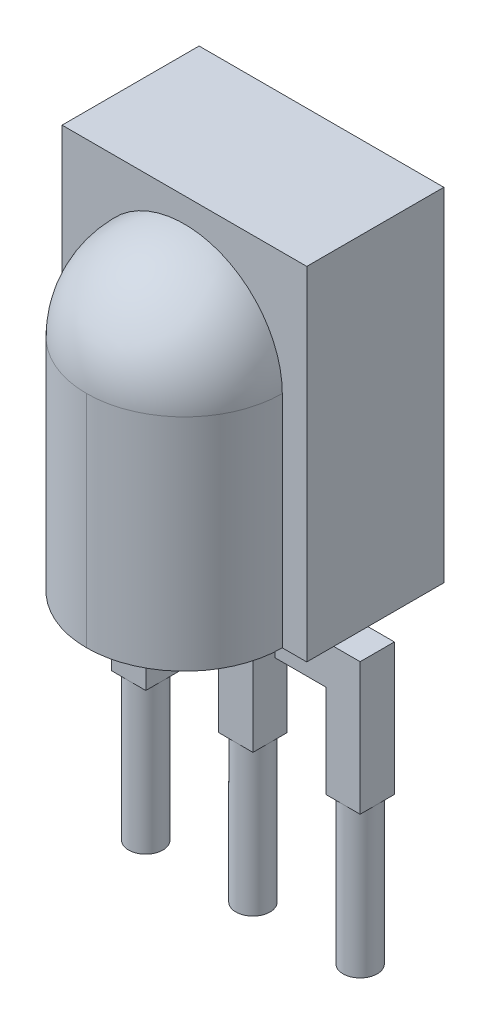
ISO-10303-21;
HEADER;
FILE_DESCRIPTION(('STEP AP214'),'2;1');
FILE_NAME('part.step','',(''),(''),'','','');
FILE_SCHEMA(('AUTOMOTIVE_DESIGN { 1 0 10303 214 1 1 1 1 }'));
ENDSEC;
DATA;
#1=APPLICATION_CONTEXT('core data for automotive mechanical design processes');
#2=APPLICATION_PROTOCOL_DEFINITION('international standard','automotive_design',2000,#1);
#3=PRODUCT_CONTEXT('',#1,'mechanical');
#4=PRODUCT('Part','Part','',(#3));
#5=PRODUCT_RELATED_PRODUCT_CATEGORY('part','',(#4));
#6=PRODUCT_DEFINITION_FORMATION('','',#4);
#7=PRODUCT_DEFINITION_CONTEXT('part definition',#1,'design');
#8=PRODUCT_DEFINITION('design','',#6,#7);
#9=PRODUCT_DEFINITION_SHAPE('','',#8);
#10=(LENGTH_UNIT() NAMED_UNIT(*) SI_UNIT(.MILLI.,.METRE.));
#11=(NAMED_UNIT(*) PLANE_ANGLE_UNIT() SI_UNIT($,.RADIAN.));
#12=(NAMED_UNIT(*) SI_UNIT($,.STERADIAN.) SOLID_ANGLE_UNIT());
#13=UNCERTAINTY_MEASURE_WITH_UNIT(LENGTH_MEASURE(1.E-05),#10,'distance_accuracy_value','');
#14=(GEOMETRIC_REPRESENTATION_CONTEXT(3) GLOBAL_UNCERTAINTY_ASSIGNED_CONTEXT((#13)) GLOBAL_UNIT_ASSIGNED_CONTEXT((#10,
#11,#12)) REPRESENTATION_CONTEXT('',''));
#15=CARTESIAN_POINT('',(0.,0.,0.));
#16=DIRECTION('',(0.,0.,1.));
#17=DIRECTION('',(1.,0.,0.));
#18=AXIS2_PLACEMENT_3D('',#15,#16,#17);
#19=CARTESIAN_POINT('',(0.,-3.2,0.));
#20=DIRECTION('',(0.,1.,0.));
#21=DIRECTION('',(0.,0.,1.));
#22=AXIS2_PLACEMENT_3D('',#19,#20,#21);
#23=PLANE('',#22);
#24=CARTESIAN_POINT('',(4.69,-3.2,-1.4));
#25=DIRECTION('',(0.,-1.,0.));
#26=DIRECTION('',(0.,0.,-1.));
#27=AXIS2_PLACEMENT_3D('',#24,#25,#26);
#28=CIRCLE('',#27,0.35);
#29=CARTESIAN_POINT('',(4.69,-3.2,-1.75));
#30=VERTEX_POINT('',#29);
#31=CARTESIAN_POINT('',(5.04,-3.2,-1.4));
#32=VERTEX_POINT('',#31);
#33=EDGE_CURVE('E44',#30,#32,#28,.T.);
#34=ORIENTED_EDGE('',*,*,#33,.F.);
#35=DIRECTION('',(1.,0.,0.));
#36=VECTOR('',#35,1.);
#37=CARTESIAN_POINT('',(5.04,-3.2,-1.75));
#38=LINE('',#37,#36);
#39=CARTESIAN_POINT('',(5.04,-3.2,-1.75));
#40=VERTEX_POINT('',#39);
#41=EDGE_CURVE('E257',#30,#40,#38,.T.);
#42=ORIENTED_EDGE('',*,*,#41,.T.);
#43=DIRECTION('',(0.,0.,1.));
#44=VECTOR('',#43,1.);
#45=CARTESIAN_POINT('',(5.04,-3.2,-1.05));
#46=LINE('',#45,#44);
#47=EDGE_CURVE('E270',#40,#32,#46,.T.);
#48=ORIENTED_EDGE('',*,*,#47,.T.);
#49=EDGE_LOOP('',(#34,#42,#48));
#50=FACE_BOUND('',#49,.T.);
#51=ADVANCED_FACE('F33',(#50),#23,.F.);
#52=CARTESIAN_POINT('',(4.69,-3.2,-1.05));
#53=VERTEX_POINT('',#52);
#54=EDGE_CURVE('E11',#32,#53,#28,.T.);
#55=ORIENTED_EDGE('',*,*,#54,.F.);
#56=CARTESIAN_POINT('',(5.04,-3.2,-1.05));
#57=VERTEX_POINT('',#56);
#58=EDGE_CURVE('E312',#32,#57,#46,.T.);
#59=ORIENTED_EDGE('',*,*,#58,.T.);
#60=DIRECTION('',(-1.,0.,0.));
#61=VECTOR('',#60,1.);
#62=CARTESIAN_POINT('',(5.04,-3.2,-1.05));
#63=LINE('',#62,#61);
#64=EDGE_CURVE('E313',#57,#53,#63,.T.);
#65=ORIENTED_EDGE('',*,*,#64,.T.);
#66=EDGE_LOOP('',(#55,#59,#65));
#67=FACE_BOUND('',#66,.T.);
#68=ADVANCED_FACE('F542',(#67),#23,.F.);
#69=CARTESIAN_POINT('',(4.34,-3.2,-1.4));
#70=VERTEX_POINT('',#69);
#71=EDGE_CURVE('E42',#53,#70,#28,.T.);
#72=ORIENTED_EDGE('',*,*,#71,.F.);
#73=CARTESIAN_POINT('',(4.34,-3.2,-1.05));
#74=VERTEX_POINT('',#73);
#75=EDGE_CURVE('E311',#53,#74,#63,.T.);
#76=ORIENTED_EDGE('',*,*,#75,.T.);
#77=DIRECTION('',(0.,0.,-1.));
#78=VECTOR('',#77,1.);
#79=CARTESIAN_POINT('',(4.34,-3.2,-1.05));
#80=LINE('',#79,#78);
#81=EDGE_CURVE('E268',#74,#70,#80,.T.);
#82=ORIENTED_EDGE('',*,*,#81,.T.);
#83=EDGE_LOOP('',(#72,#76,#82));
#84=FACE_BOUND('',#83,.T.);
#85=ADVANCED_FACE('F548',(#84),#23,.F.);
#86=EDGE_CURVE('E51',#70,#30,#28,.T.);
#87=ORIENTED_EDGE('',*,*,#86,.F.);
#88=CARTESIAN_POINT('',(4.34,-3.2,-1.75));
#89=VERTEX_POINT('',#88);
#90=EDGE_CURVE('E252',#70,#89,#80,.T.);
#91=ORIENTED_EDGE('',*,*,#90,.T.);
#92=EDGE_CURVE('E249',#89,#30,#38,.T.);
#93=ORIENTED_EDGE('',*,*,#92,.T.);
#94=EDGE_LOOP('',(#87,#91,#93));
#95=FACE_BOUND('',#94,.T.);
#96=ADVANCED_FACE('F251',(#95),#23,.F.);
#97=CARTESIAN_POINT('',(0.,-3.2,0.));
#98=DIRECTION('',(0.,-1.,0.));
#99=DIRECTION('',(0.,0.,-1.));
#100=AXIS2_PLACEMENT_3D('',#97,#98,#99);
#101=PLANE('',#100);
#102=CARTESIAN_POINT('',(2.5,-3.2,-1.4));
#103=DIRECTION('',(0.,-1.,0.));
#104=DIRECTION('',(0.,0.,-1.));
#105=AXIS2_PLACEMENT_3D('',#102,#103,#104);
#106=CIRCLE('',#105,0.35);
#107=CARTESIAN_POINT('',(2.5,-3.2,-1.75));
#108=VERTEX_POINT('',#107);
#109=CARTESIAN_POINT('',(2.85,-3.2,-1.4));
#110=VERTEX_POINT('',#109);
#111=EDGE_CURVE('E278',#108,#110,#106,.T.);
#112=ORIENTED_EDGE('',*,*,#111,.F.);
#113=DIRECTION('',(1.,0.,0.));
#114=VECTOR('',#113,1.);
#115=CARTESIAN_POINT('',(2.15,-3.2,-1.75));
#116=LINE('',#115,#114);
#117=CARTESIAN_POINT('',(2.85,-3.2,-1.75));
#118=VERTEX_POINT('',#117);
#119=EDGE_CURVE('E298',#108,#118,#116,.T.);
#120=ORIENTED_EDGE('',*,*,#119,.T.);
#121=DIRECTION('',(0.,0.,1.));
#122=VECTOR('',#121,1.);
#123=CARTESIAN_POINT('',(2.85,-3.2,-1.05));
#124=LINE('',#123,#122);
#125=EDGE_CURVE('E302',#118,#110,#124,.T.);
#126=ORIENTED_EDGE('',*,*,#125,.T.);
#127=EDGE_LOOP('',(#112,#120,#126));
#128=FACE_BOUND('',#127,.T.);
#129=ADVANCED_FACE('F553',(#128),#101,.T.);
#130=CARTESIAN_POINT('',(2.5,-3.2,-1.05));
#131=VERTEX_POINT('',#130);
#132=EDGE_CURVE('E274',#110,#131,#106,.T.);
#133=ORIENTED_EDGE('',*,*,#132,.F.);
#134=CARTESIAN_POINT('',(2.85,-3.2,-1.05));
#135=VERTEX_POINT('',#134);
#136=EDGE_CURVE('E301',#110,#135,#124,.T.);
#137=ORIENTED_EDGE('',*,*,#136,.T.);
#138=DIRECTION('',(-1.,0.,0.));
#139=VECTOR('',#138,1.);
#140=CARTESIAN_POINT('',(2.15,-3.2,-1.05));
#141=LINE('',#140,#139);
#142=EDGE_CURVE('E306',#135,#131,#141,.T.);
#143=ORIENTED_EDGE('',*,*,#142,.T.);
#144=EDGE_LOOP('',(#133,#137,#143));
#145=FACE_BOUND('',#144,.T.);
#146=ADVANCED_FACE('F558',(#145),#101,.T.);
#147=CARTESIAN_POINT('',(2.15,-3.2,-1.4));
#148=VERTEX_POINT('',#147);
#149=EDGE_CURVE('E276',#131,#148,#106,.T.);
#150=ORIENTED_EDGE('',*,*,#149,.F.);
#151=CARTESIAN_POINT('',(2.15,-3.2,-1.05));
#152=VERTEX_POINT('',#151);
#153=EDGE_CURVE('E305',#131,#152,#141,.T.);
#154=ORIENTED_EDGE('',*,*,#153,.T.);
#155=DIRECTION('',(0.,0.,-1.));
#156=VECTOR('',#155,1.);
#157=CARTESIAN_POINT('',(2.15,-3.2,-1.05));
#158=LINE('',#157,#156);
#159=EDGE_CURVE('E295',#152,#148,#158,.T.);
#160=ORIENTED_EDGE('',*,*,#159,.T.);
#161=EDGE_LOOP('',(#150,#154,#160));
#162=FACE_BOUND('',#161,.T.);
#163=ADVANCED_FACE('F825',(#162),#101,.T.);
#164=CARTESIAN_POINT('',(0.,-3.2,0.));
#165=DIRECTION('',(0.,-1.,0.));
#166=DIRECTION('',(0.,0.,-1.));
#167=AXIS2_PLACEMENT_3D('',#164,#165,#166);
#168=PLANE('',#167);
#169=CARTESIAN_POINT('',(0.310000000000001,-3.2,-1.4));
#170=DIRECTION('',(0.,-1.,0.));
#171=DIRECTION('',(0.,0.,-1.));
#172=AXIS2_PLACEMENT_3D('',#169,#170,#171);
#173=CIRCLE('',#172,0.35);
#174=CARTESIAN_POINT('',(0.310000000000001,-3.2,-1.75));
#175=VERTEX_POINT('',#174);
#176=CARTESIAN_POINT('',(0.660000000000001,-3.2,-1.4));
#177=VERTEX_POINT('',#176);
#178=EDGE_CURVE('E283',#175,#177,#173,.T.);
#179=ORIENTED_EDGE('',*,*,#178,.F.);
#180=DIRECTION('',(1.,0.,0.));
#181=VECTOR('',#180,1.);
#182=CARTESIAN_POINT('',(-0.0399999999999988,-3.2,-1.75));
#183=LINE('',#182,#181);
#184=CARTESIAN_POINT('',(0.660000000000001,-3.2,-1.75));
#185=VERTEX_POINT('',#184);
#186=EDGE_CURVE('E389',#175,#185,#183,.T.);
#187=ORIENTED_EDGE('',*,*,#186,.T.);
#188=DIRECTION('',(0.,0.,1.));
#189=VECTOR('',#188,1.);
#190=CARTESIAN_POINT('',(0.660000000000001,-3.2,-1.05));
#191=LINE('',#190,#189);
#192=EDGE_CURVE('E379',#185,#177,#191,.T.);
#193=ORIENTED_EDGE('',*,*,#192,.T.);
#194=EDGE_LOOP('',(#179,#187,#193));
#195=FACE_BOUND('',#194,.T.);
#196=ADVANCED_FACE('F817',(#195),#168,.T.);
#197=CARTESIAN_POINT('',(0.310000000000001,-3.2,-1.05));
#198=VERTEX_POINT('',#197);
#199=EDGE_CURVE('E293',#177,#198,#173,.T.);
#200=ORIENTED_EDGE('',*,*,#199,.F.);
#201=CARTESIAN_POINT('',(0.660000000000001,-3.2,-1.05));
#202=VERTEX_POINT('',#201);
#203=EDGE_CURVE('E385',#177,#202,#191,.T.);
#204=ORIENTED_EDGE('',*,*,#203,.T.);
#205=DIRECTION('',(-1.,0.,0.));
#206=VECTOR('',#205,1.);
#207=CARTESIAN_POINT('',(-0.0399999999999988,-3.2,-1.05));
#208=LINE('',#207,#206);
#209=EDGE_CURVE('E354',#202,#198,#208,.T.);
#210=ORIENTED_EDGE('',*,*,#209,.T.);
#211=EDGE_LOOP('',(#200,#204,#210));
#212=FACE_BOUND('',#211,.T.);
#213=ADVANCED_FACE('F806',(#212),#168,.T.);
#214=CARTESIAN_POINT('',(-0.0399999999999988,-3.2,-1.4));
#215=VERTEX_POINT('',#214);
#216=EDGE_CURVE('E396',#198,#215,#173,.T.);
#217=ORIENTED_EDGE('',*,*,#216,.F.);
#218=CARTESIAN_POINT('',(-0.0399999999999988,-3.2,-1.05));
#219=VERTEX_POINT('',#218);
#220=EDGE_CURVE('E376',#198,#219,#208,.T.);
#221=ORIENTED_EDGE('',*,*,#220,.T.);
#222=DIRECTION('',(0.,0.,-1.));
#223=VECTOR('',#222,1.);
#224=CARTESIAN_POINT('',(-0.0399999999999988,-3.2,-1.05));
#225=LINE('',#224,#223);
#226=EDGE_CURVE('E319',#219,#215,#225,.T.);
#227=ORIENTED_EDGE('',*,*,#226,.T.);
#228=EDGE_LOOP('',(#217,#221,#227));
#229=FACE_BOUND('',#228,.T.);
#230=ADVANCED_FACE('F395',(#229),#168,.T.);
#231=CARTESIAN_POINT('',(0.,-1.3,0.));
#232=DIRECTION('',(0.,1.,0.));
#233=DIRECTION('',(0.,0.,1.));
#234=AXIS2_PLACEMENT_3D('',#231,#232,#233);
#235=PLANE('',#234);
#236=DIRECTION('',(0.,0.,-1.));
#237=VECTOR('',#236,1.);
#238=CARTESIAN_POINT('',(4.34,-1.3,-1.05));
#239=LINE('',#238,#237);
#240=CARTESIAN_POINT('',(4.34,-1.3,-1.05));
#241=VERTEX_POINT('',#240);
#242=CARTESIAN_POINT('',(4.34,-1.3,-1.75));
#243=VERTEX_POINT('',#242);
#244=EDGE_CURVE('E309',#241,#243,#239,.T.);
#245=ORIENTED_EDGE('',*,*,#244,.F.);
#246=DIRECTION('',(-1.,0.,0.));
#247=VECTOR('',#246,1.);
#248=CARTESIAN_POINT('',(3.3,-1.3,-1.05));
#249=LINE('',#248,#247);
#250=CARTESIAN_POINT('',(3.3,-1.3,-1.05));
#251=VERTEX_POINT('',#250);
#252=EDGE_CURVE('E359',#241,#251,#249,.T.);
#253=ORIENTED_EDGE('',*,*,#252,.T.);
#254=DIRECTION('',(0.,0.,-1.));
#255=VECTOR('',#254,1.);
#256=CARTESIAN_POINT('',(3.3,-1.3,-1.05));
#257=LINE('',#256,#255);
#258=CARTESIAN_POINT('',(3.3,-1.3,-1.75));
#259=VERTEX_POINT('',#258);
#260=EDGE_CURVE('E358',#251,#259,#257,.T.);
#261=ORIENTED_EDGE('',*,*,#260,.T.);
#262=DIRECTION('',(1.,0.,0.));
#263=VECTOR('',#262,1.);
#264=CARTESIAN_POINT('',(3.3,-1.3,-1.75));
#265=LINE('',#264,#263);
#266=EDGE_CURVE('E325',#259,#243,#265,.T.);
#267=ORIENTED_EDGE('',*,*,#266,.T.);
#268=EDGE_LOOP('',(#245,#253,#261,#267));
#269=FACE_BOUND('',#268,.T.);
#270=ADVANCED_FACE('F582',(#269),#235,.F.);
#271=CARTESIAN_POINT('',(0.,-1.3,0.));
#272=DIRECTION('',(0.,1.,0.));
#273=DIRECTION('',(0.,0.,1.));
#274=AXIS2_PLACEMENT_3D('',#271,#272,#273);
#275=PLANE('',#274);
#276=DIRECTION('',(0.,0.,1.));
#277=VECTOR('',#276,1.);
#278=CARTESIAN_POINT('',(0.660000000000001,-1.3,-1.05));
#279=LINE('',#278,#277);
#280=CARTESIAN_POINT('',(0.660000000000001,-1.3,-1.75));
#281=VERTEX_POINT('',#280);
#282=CARTESIAN_POINT('',(0.660000000000001,-1.3,-1.05));
#283=VERTEX_POINT('',#282);
#284=EDGE_CURVE('E332',#281,#283,#279,.T.);
#285=ORIENTED_EDGE('',*,*,#284,.F.);
#286=DIRECTION('',(1.,0.,0.));
#287=VECTOR('',#286,1.);
#288=CARTESIAN_POINT('',(1.7,-1.3,-1.75));
#289=LINE('',#288,#287);
#290=CARTESIAN_POINT('',(1.7,-1.3,-1.75));
#291=VERTEX_POINT('',#290);
#292=EDGE_CURVE('E346',#281,#291,#289,.T.);
#293=ORIENTED_EDGE('',*,*,#292,.T.);
#294=DIRECTION('',(0.,0.,1.));
#295=VECTOR('',#294,1.);
#296=CARTESIAN_POINT('',(1.7,-1.3,-1.05));
#297=LINE('',#296,#295);
#298=CARTESIAN_POINT('',(1.7,-1.3,-1.05));
#299=VERTEX_POINT('',#298);
#300=EDGE_CURVE('E497',#291,#299,#297,.T.);
#301=ORIENTED_EDGE('',*,*,#300,.T.);
#302=DIRECTION('',(-1.,0.,0.));
#303=VECTOR('',#302,1.);
#304=CARTESIAN_POINT('',(1.7,-1.3,-1.05));
#305=LINE('',#304,#303);
#306=EDGE_CURVE('E495',#299,#283,#305,.T.);
#307=ORIENTED_EDGE('',*,*,#306,.T.);
#308=EDGE_LOOP('',(#285,#293,#301,#307));
#309=FACE_BOUND('',#308,.T.);
#310=ADVANCED_FACE('F521',(#309),#275,.F.);
#311=CARTESIAN_POINT('',(0.,0.,0.));
#312=DIRECTION('',(0.,-1.,0.));
#313=DIRECTION('',(0.,0.,-1.));
#314=AXIS2_PLACEMENT_3D('',#311,#312,#313);
#315=PLANE('',#314);
#316=DIRECTION('',(1.,0.,0.));
#317=VECTOR('',#316,1.);
#318=CARTESIAN_POINT('',(2.15,0.,-1.75));
#319=LINE('',#318,#317);
#320=CARTESIAN_POINT('',(2.15,0.,-1.75));
#321=VERTEX_POINT('',#320);
#322=CARTESIAN_POINT('',(2.85,0.,-1.75));
#323=VERTEX_POINT('',#322);
#324=EDGE_CURVE('E461',#321,#323,#319,.T.);
#325=ORIENTED_EDGE('',*,*,#324,.F.);
#326=DIRECTION('',(0.,0.,-1.));
#327=VECTOR('',#326,1.);
#328=CARTESIAN_POINT('',(2.15,0.,-1.05));
#329=LINE('',#328,#327);
#330=CARTESIAN_POINT('',(2.15,0.,-1.05));
#331=VERTEX_POINT('',#330);
#332=EDGE_CURVE('E428',#331,#321,#329,.T.);
#333=ORIENTED_EDGE('',*,*,#332,.F.);
#334=DIRECTION('',(-1.,0.,0.));
#335=VECTOR('',#334,1.);
#336=CARTESIAN_POINT('',(2.85,0.,-1.05));
#337=LINE('',#336,#335);
#338=CARTESIAN_POINT('',(2.85,0.,-1.05));
#339=VERTEX_POINT('',#338);
#340=EDGE_CURVE('E466',#339,#331,#337,.T.);
#341=ORIENTED_EDGE('',*,*,#340,.F.);
#342=DIRECTION('',(0.,0.,1.));
#343=VECTOR('',#342,1.);
#344=CARTESIAN_POINT('',(2.85,0.,-1.05));
#345=LINE('',#344,#343);
#346=EDGE_CURVE('E463',#323,#339,#345,.T.);
#347=ORIENTED_EDGE('',*,*,#346,.F.);
#348=EDGE_LOOP('',(#325,#333,#341,#347));
#349=FACE_BOUND('',#348,.T.);
#350=DIRECTION('',(1.,0.,0.));
#351=VECTOR('',#350,1.);
#352=CARTESIAN_POINT('',(0.,0.,0.));
#353=LINE('',#352,#351);
#354=CARTESIAN_POINT('',(4.5,0.,0.));
#355=VERTEX_POINT('',#354);
#356=CARTESIAN_POINT('',(5.,0.,0.));
#357=VERTEX_POINT('',#356);
#358=EDGE_CURVE('E1050',#355,#357,#353,.T.);
#359=ORIENTED_EDGE('',*,*,#358,.F.);
#360=CARTESIAN_POINT('',(2.5,0.,0.));
#361=DIRECTION('',(0.,-1.,0.));
#362=DIRECTION('',(0.,0.,-1.));
#363=AXIS2_PLACEMENT_3D('',#360,#361,#362);
#364=CIRCLE('',#363,2.);
#365=CARTESIAN_POINT('',(2.5,0.,2.));
#366=VERTEX_POINT('',#365);
#367=EDGE_CURVE('E403',#355,#366,#364,.T.);
#368=ORIENTED_EDGE('',*,*,#367,.T.);
#369=CARTESIAN_POINT('',(2.5,0.,0.));
#370=DIRECTION('',(0.,-1.,0.));
#371=DIRECTION('',(0.,0.,-1.));
#372=AXIS2_PLACEMENT_3D('',#369,#370,#371);
#373=CIRCLE('',#372,2.);
#374=CARTESIAN_POINT('',(0.500000000000001,0.,0.));
#375=VERTEX_POINT('',#374);
#376=EDGE_CURVE('E404',#366,#375,#373,.T.);
#377=ORIENTED_EDGE('',*,*,#376,.T.);
#378=CARTESIAN_POINT('',(0.,0.,0.));
#379=VERTEX_POINT('',#378);
#380=EDGE_CURVE('E1053',#379,#375,#353,.T.);
#381=ORIENTED_EDGE('',*,*,#380,.F.);
#382=DIRECTION('',(0.,0.,1.));
#383=VECTOR('',#382,1.);
#384=CARTESIAN_POINT('',(0.,0.,0.));
#385=LINE('',#384,#383);
#386=CARTESIAN_POINT('',(0.,0.,-2.8));
#387=VERTEX_POINT('',#386);
#388=EDGE_CURVE('E1054',#387,#379,#385,.T.);
#389=ORIENTED_EDGE('',*,*,#388,.F.);
#390=DIRECTION('',(-1.,0.,0.));
#391=VECTOR('',#390,1.);
#392=CARTESIAN_POINT('',(0.,0.,-2.8));
#393=LINE('',#392,#391);
#394=CARTESIAN_POINT('',(5.,0.,-2.8));
#395=VERTEX_POINT('',#394);
#396=EDGE_CURVE('E1063',#395,#387,#393,.T.);
#397=ORIENTED_EDGE('',*,*,#396,.F.);
#398=DIRECTION('',(0.,0.,-1.));
#399=VECTOR('',#398,1.);
#400=CARTESIAN_POINT('',(5.,0.,0.));
#401=LINE('',#400,#399);
#402=EDGE_CURVE('E1060',#357,#395,#401,.T.);
#403=ORIENTED_EDGE('',*,*,#402,.F.);
#404=EDGE_LOOP('',(#359,#368,#377,#381,#389,#397,#403));
#405=FACE_BOUND('',#404,.T.);
#406=DIRECTION('',(0.,0.,-1.));
#407=VECTOR('',#406,1.);
#408=CARTESIAN_POINT('',(3.3,0.,-1.05));
#409=LINE('',#408,#407);
#410=CARTESIAN_POINT('',(3.3,0.,-1.05));
#411=VERTEX_POINT('',#410);
#412=CARTESIAN_POINT('',(3.3,0.,-1.75));
#413=VERTEX_POINT('',#412);
#414=EDGE_CURVE('E1030',#411,#413,#409,.T.);
#415=ORIENTED_EDGE('',*,*,#414,.F.);
#416=DIRECTION('',(-1.,0.,0.));
#417=VECTOR('',#416,1.);
#418=CARTESIAN_POINT('',(4.,0.,-1.05));
#419=LINE('',#418,#417);
#420=CARTESIAN_POINT('',(4.,0.,-1.05));
#421=VERTEX_POINT('',#420);
#422=EDGE_CURVE('E478',#421,#411,#419,.T.);
#423=ORIENTED_EDGE('',*,*,#422,.F.);
#424=DIRECTION('',(0.,0.,1.));
#425=VECTOR('',#424,1.);
#426=CARTESIAN_POINT('',(4.,0.,-1.05));
#427=LINE('',#426,#425);
#428=CARTESIAN_POINT('',(4.,0.,-1.75));
#429=VERTEX_POINT('',#428);
#430=EDGE_CURVE('E488',#429,#421,#427,.T.);
#431=ORIENTED_EDGE('',*,*,#430,.F.);
#432=DIRECTION('',(1.,0.,0.));
#433=VECTOR('',#432,1.);
#434=CARTESIAN_POINT('',(4.,0.,-1.75));
#435=LINE('',#434,#433);
#436=EDGE_CURVE('E1031',#413,#429,#435,.T.);
#437=ORIENTED_EDGE('',*,*,#436,.F.);
#438=EDGE_LOOP('',(#415,#423,#431,#437));
#439=FACE_BOUND('',#438,.T.);
#440=DIRECTION('',(1.,0.,0.));
#441=VECTOR('',#440,1.);
#442=CARTESIAN_POINT('',(1.,0.,-1.75));
#443=LINE('',#442,#441);
#444=CARTESIAN_POINT('',(1.,0.,-1.75));
#445=VERTEX_POINT('',#444);
#446=CARTESIAN_POINT('',(1.7,0.,-1.75));
#447=VERTEX_POINT('',#446);
#448=EDGE_CURVE('E448',#445,#447,#443,.T.);
#449=ORIENTED_EDGE('',*,*,#448,.F.);
#450=DIRECTION('',(0.,0.,-1.));
#451=VECTOR('',#450,1.);
#452=CARTESIAN_POINT('',(1.,0.,-1.05));
#453=LINE('',#452,#451);
#454=CARTESIAN_POINT('',(1.,0.,-1.05));
#455=VERTEX_POINT('',#454);
#456=EDGE_CURVE('E445',#455,#445,#453,.T.);
#457=ORIENTED_EDGE('',*,*,#456,.F.);
#458=DIRECTION('',(-1.,0.,0.));
#459=VECTOR('',#458,1.);
#460=CARTESIAN_POINT('',(1.,0.,-1.05));
#461=LINE('',#460,#459);
#462=CARTESIAN_POINT('',(1.7,0.,-1.05));
#463=VERTEX_POINT('',#462);
#464=EDGE_CURVE('E437',#463,#455,#461,.T.);
#465=ORIENTED_EDGE('',*,*,#464,.F.);
#466=DIRECTION('',(0.,0.,1.));
#467=VECTOR('',#466,1.);
#468=CARTESIAN_POINT('',(1.7,0.,-1.05));
#469=LINE('',#468,#467);
#470=EDGE_CURVE('E451',#447,#463,#469,.T.);
#471=ORIENTED_EDGE('',*,*,#470,.F.);
#472=EDGE_LOOP('',(#449,#457,#465,#471));
#473=FACE_BOUND('',#472,.T.);
#474=ADVANCED_FACE('F581',(#349,#405,#439,#473),#315,.T.);
#475=CARTESIAN_POINT('',(0.,7.,0.));
#476=DIRECTION('',(0.,0.,-1.));
#477=DIRECTION('',(-1.,0.,0.));
#478=AXIS2_PLACEMENT_3D('',#475,#476,#477);
#479=PLANE('',#478);
#480=DIRECTION('',(0.,-1.,0.));
#481=VECTOR('',#480,1.);
#482=CARTESIAN_POINT('',(0.500000000000001,4.5,0.));
#483=LINE('',#482,#481);
#484=CARTESIAN_POINT('',(0.500000000000001,4.5,0.));
#485=VERTEX_POINT('',#484);
#486=EDGE_CURVE('E425',#485,#375,#483,.T.);
#487=ORIENTED_EDGE('',*,*,#486,.F.);
#488=CARTESIAN_POINT('',(2.5,4.5,0.));
#489=DIRECTION('',(0.,0.,1.));
#490=DIRECTION('',(-1.,0.,0.));
#491=AXIS2_PLACEMENT_3D('',#488,#489,#490);
#492=CIRCLE('',#491,2.);
#493=CARTESIAN_POINT('',(4.5,4.5,0.));
#494=VERTEX_POINT('',#493);
#495=EDGE_CURVE('E1040',#494,#485,#492,.T.);
#496=ORIENTED_EDGE('',*,*,#495,.F.);
#497=DIRECTION('',(0.,1.,0.));
#498=VECTOR('',#497,1.);
#499=CARTESIAN_POINT('',(4.5,4.5,0.));
#500=LINE('',#499,#498);
#501=EDGE_CURVE('E1045',#355,#494,#500,.T.);
#502=ORIENTED_EDGE('',*,*,#501,.F.);
#503=ORIENTED_EDGE('',*,*,#358,.T.);
#504=DIRECTION('',(0.,-1.,0.));
#505=VECTOR('',#504,1.);
#506=CARTESIAN_POINT('',(5.,7.,0.));
#507=LINE('',#506,#505);
#508=CARTESIAN_POINT('',(5.,7.,0.));
#509=VERTEX_POINT('',#508);
#510=EDGE_CURVE('E1073',#509,#357,#507,.T.);
#511=ORIENTED_EDGE('',*,*,#510,.F.);
#512=DIRECTION('',(1.,0.,0.));
#513=VECTOR('',#512,1.);
#514=CARTESIAN_POINT('',(0.,7.,0.));
#515=LINE('',#514,#513);
#516=CARTESIAN_POINT('',(0.,7.,0.));
#517=VERTEX_POINT('',#516);
#518=EDGE_CURVE('E1079',#517,#509,#515,.T.);
#519=ORIENTED_EDGE('',*,*,#518,.F.);
#520=DIRECTION('',(0.,-1.,0.));
#521=VECTOR('',#520,1.);
#522=CARTESIAN_POINT('',(0.,7.,0.));
#523=LINE('',#522,#521);
#524=EDGE_CURVE('E409',#517,#379,#523,.T.);
#525=ORIENTED_EDGE('',*,*,#524,.T.);
#526=ORIENTED_EDGE('',*,*,#380,.T.);
#527=EDGE_LOOP('',(#487,#496,#502,#503,#511,#519,#525,#526));
#528=FACE_BOUND('',#527,.T.);
#529=ADVANCED_FACE('F670',(#528),#479,.F.);
#530=CARTESIAN_POINT('',(0.,7.,0.));
#531=DIRECTION('',(1.,0.,0.));
#532=DIRECTION('',(0.,0.,-1.));
#533=AXIS2_PLACEMENT_3D('',#530,#531,#532);
#534=PLANE('',#533);
#535=ORIENTED_EDGE('',*,*,#388,.T.);
#536=ORIENTED_EDGE('',*,*,#524,.F.);
#537=DIRECTION('',(0.,0.,1.));
#538=VECTOR('',#537,1.);
#539=CARTESIAN_POINT('',(0.,7.,0.));
#540=LINE('',#539,#538);
#541=CARTESIAN_POINT('',(0.,7.,-2.8));
#542=VERTEX_POINT('',#541);
#543=EDGE_CURVE('E1065',#542,#517,#540,.T.);
#544=ORIENTED_EDGE('',*,*,#543,.F.);
#545=DIRECTION('',(0.,-1.,0.));
#546=VECTOR('',#545,1.);
#547=CARTESIAN_POINT('',(0.,7.,-2.8));
#548=LINE('',#547,#546);
#549=EDGE_CURVE('E1066',#542,#387,#548,.T.);
#550=ORIENTED_EDGE('',*,*,#549,.T.);
#551=EDGE_LOOP('',(#535,#536,#544,#550));
#552=FACE_BOUND('',#551,.T.);
#553=ADVANCED_FACE('F710',(#552),#534,.F.);
#554=CARTESIAN_POINT('',(5.,7.,0.));
#555=DIRECTION('',(-1.,0.,0.));
#556=DIRECTION('',(0.,0.,1.));
#557=AXIS2_PLACEMENT_3D('',#554,#555,#556);
#558=PLANE('',#557);
#559=ORIENTED_EDGE('',*,*,#402,.T.);
#560=DIRECTION('',(0.,-1.,0.));
#561=VECTOR('',#560,1.);
#562=CARTESIAN_POINT('',(5.,7.,-2.8));
#563=LINE('',#562,#561);
#564=CARTESIAN_POINT('',(5.,7.,-2.8));
#565=VERTEX_POINT('',#564);
#566=EDGE_CURVE('E1069',#565,#395,#563,.T.);
#567=ORIENTED_EDGE('',*,*,#566,.F.);
#568=DIRECTION('',(0.,0.,-1.));
#569=VECTOR('',#568,1.);
#570=CARTESIAN_POINT('',(5.,7.,0.));
#571=LINE('',#570,#569);
#572=EDGE_CURVE('E1093',#509,#565,#571,.T.);
#573=ORIENTED_EDGE('',*,*,#572,.F.);
#574=ORIENTED_EDGE('',*,*,#510,.T.);
#575=EDGE_LOOP('',(#559,#567,#573,#574));
#576=FACE_BOUND('',#575,.T.);
#577=ADVANCED_FACE('F730',(#576),#558,.F.);
#578=CARTESIAN_POINT('',(0.,7.,-2.8));
#579=DIRECTION('',(0.,0.,1.));
#580=DIRECTION('',(1.,0.,0.));
#581=AXIS2_PLACEMENT_3D('',#578,#579,#580);
#582=PLANE('',#581);
#583=ORIENTED_EDGE('',*,*,#396,.T.);
#584=ORIENTED_EDGE('',*,*,#549,.F.);
#585=DIRECTION('',(-1.,0.,0.));
#586=VECTOR('',#585,1.);
#587=CARTESIAN_POINT('',(0.,7.,-2.8));
#588=LINE('',#587,#586);
#589=EDGE_CURVE('E1070',#565,#542,#588,.T.);
#590=ORIENTED_EDGE('',*,*,#589,.F.);
#591=ORIENTED_EDGE('',*,*,#566,.T.);
#592=EDGE_LOOP('',(#583,#584,#590,#591));
#593=FACE_BOUND('',#592,.T.);
#594=ADVANCED_FACE('F720',(#593),#582,.F.);
#595=CARTESIAN_POINT('',(0.,7.,0.));
#596=DIRECTION('',(0.,-1.,0.));
#597=DIRECTION('',(0.,0.,-1.));
#598=AXIS2_PLACEMENT_3D('',#595,#596,#597);
#599=PLANE('',#598);
#600=ORIENTED_EDGE('',*,*,#543,.T.);
#601=ORIENTED_EDGE('',*,*,#518,.T.);
#602=ORIENTED_EDGE('',*,*,#572,.T.);
#603=ORIENTED_EDGE('',*,*,#589,.T.);
#604=EDGE_LOOP('',(#600,#601,#602,#603));
#605=FACE_BOUND('',#604,.T.);
#606=ADVANCED_FACE('F700',(#605),#599,.F.);
#607=CARTESIAN_POINT('',(2.5,4.5,0.));
#608=DIRECTION('',(0.,-1.,0.));
#609=DIRECTION('',(1.,0.,0.));
#610=AXIS2_PLACEMENT_3D('',#607,#608,#609);
#611=CYLINDRICAL_SURFACE('',#610,2.);
#612=CARTESIAN_POINT('',(2.5,4.5,0.));
#613=DIRECTION('',(0.,1.,0.));
#614=DIRECTION('',(0.,0.,1.));
#615=AXIS2_PLACEMENT_3D('',#612,#613,#614);
#616=CIRCLE('',#615,2.);
#617=CARTESIAN_POINT('',(2.5,4.5,2.));
#618=VERTEX_POINT('',#617);
#619=EDGE_CURVE('E423',#485,#618,#616,.T.);
#620=ORIENTED_EDGE('',*,*,#619,.F.);
#621=ORIENTED_EDGE('',*,*,#486,.T.);
#622=ORIENTED_EDGE('',*,*,#376,.F.);
#623=DIRECTION('',(0.,-1.,0.));
#624=VECTOR('',#623,1.);
#625=CARTESIAN_POINT('',(2.5,4.5,2.));
#626=LINE('',#625,#624);
#627=EDGE_CURVE('E419',#618,#366,#626,.T.);
#628=ORIENTED_EDGE('',*,*,#627,.F.);
#629=EDGE_LOOP('',(#620,#621,#622,#628));
#630=FACE_BOUND('',#629,.T.);
#631=ADVANCED_FACE('F35',(#630),#611,.T.);
#632=CARTESIAN_POINT('',(2.5,4.5,0.));
#633=DIRECTION('',(0.,0.,1.));
#634=DIRECTION('',(1.,0.,0.));
#635=AXIS2_PLACEMENT_3D('',#632,#633,#634);
#636=SPHERICAL_SURFACE('',#635,2.);
#637=ORIENTED_EDGE('',*,*,#495,.T.);
#638=ORIENTED_EDGE('',*,*,#619,.T.);
#639=CARTESIAN_POINT('',(2.5,4.5,0.));
#640=DIRECTION('',(0.,-1.,0.));
#641=DIRECTION('',(0.,0.,-1.));
#642=AXIS2_PLACEMENT_3D('',#639,#640,#641);
#643=CIRCLE('',#642,2.);
#644=EDGE_CURVE('E416',#494,#618,#643,.T.);
#645=ORIENTED_EDGE('',*,*,#644,.F.);
#646=EDGE_LOOP('',(#637,#638,#645));
#647=FACE_BOUND('',#646,.T.);
#648=ADVANCED_FACE('F682',(#647),#636,.T.);
#649=CARTESIAN_POINT('',(2.5,4.5,0.));
#650=DIRECTION('',(0.,1.,0.));
#651=DIRECTION('',(-1.,0.,0.));
#652=AXIS2_PLACEMENT_3D('',#649,#650,#651);
#653=CYLINDRICAL_SURFACE('',#652,2.);
#654=ORIENTED_EDGE('',*,*,#367,.F.);
#655=ORIENTED_EDGE('',*,*,#501,.T.);
#656=ORIENTED_EDGE('',*,*,#644,.T.);
#657=ORIENTED_EDGE('',*,*,#627,.T.);
#658=EDGE_LOOP('',(#654,#655,#656,#657));
#659=FACE_BOUND('',#658,.T.);
#660=ADVANCED_FACE('F677',(#659),#653,.T.);
#661=CARTESIAN_POINT('',(4.,-0.5,-1.05));
#662=DIRECTION('',(0.,0.,-1.));
#663=DIRECTION('',(-1.,0.,0.));
#664=AXIS2_PLACEMENT_3D('',#661,#662,#663);
#665=PLANE('',#664);
#666=ORIENTED_EDGE('',*,*,#422,.T.);
#667=DIRECTION('',(0.,1.,0.));
#668=VECTOR('',#667,1.);
#669=CARTESIAN_POINT('',(3.3,-0.5,-1.05));
#670=LINE('',#669,#668);
#671=EDGE_CURVE('E420',#251,#411,#670,.T.);
#672=ORIENTED_EDGE('',*,*,#671,.F.);
#673=ORIENTED_EDGE('',*,*,#252,.F.);
#674=DIRECTION('',(0.,1.,0.));
#675=VECTOR('',#674,1.);
#676=CARTESIAN_POINT('',(4.34,-3.2,-1.05));
#677=LINE('',#676,#675);
#678=EDGE_CURVE('E329',#74,#241,#677,.T.);
#679=ORIENTED_EDGE('',*,*,#678,.F.);
#680=ORIENTED_EDGE('',*,*,#75,.F.);
#681=ORIENTED_EDGE('',*,*,#64,.F.);
#682=DIRECTION('',(0.,1.,0.));
#683=VECTOR('',#682,1.);
#684=CARTESIAN_POINT('',(5.04,-1.3,-1.05));
#685=LINE('',#684,#683);
#686=CARTESIAN_POINT('',(5.04,-0.5,-1.05));
#687=VERTEX_POINT('',#686);
#688=EDGE_CURVE('E1013',#57,#687,#685,.T.);
#689=ORIENTED_EDGE('',*,*,#688,.T.);
#690=DIRECTION('',(-1.,0.,0.));
#691=VECTOR('',#690,1.);
#692=CARTESIAN_POINT('',(3.3,-0.5,-1.05));
#693=LINE('',#692,#691);
#694=CARTESIAN_POINT('',(4.,-0.5,-1.05));
#695=VERTEX_POINT('',#694);
#696=EDGE_CURVE('E365',#687,#695,#693,.T.);
#697=ORIENTED_EDGE('',*,*,#696,.T.);
#698=DIRECTION('',(0.,1.,0.));
#699=VECTOR('',#698,1.);
#700=CARTESIAN_POINT('',(4.,-0.5,-1.05));
#701=LINE('',#700,#699);
#702=EDGE_CURVE('E487',#695,#421,#701,.T.);
#703=ORIENTED_EDGE('',*,*,#702,.T.);
#704=EDGE_LOOP('',(#666,#672,#673,#679,#680,#681,#689,#697,#703));
#705=FACE_BOUND('',#704,.T.);
#706=ADVANCED_FACE('F657',(#705),#665,.F.);
#707=CARTESIAN_POINT('',(3.3,-0.5,-1.05));
#708=DIRECTION('',(1.,0.,0.));
#709=DIRECTION('',(0.,0.,-1.));
#710=AXIS2_PLACEMENT_3D('',#707,#708,#709);
#711=PLANE('',#710);
#712=ORIENTED_EDGE('',*,*,#414,.T.);
#713=DIRECTION('',(0.,1.,0.));
#714=VECTOR('',#713,1.);
#715=CARTESIAN_POINT('',(3.3,-0.5,-1.75));
#716=LINE('',#715,#714);
#717=EDGE_CURVE('E493',#259,#413,#716,.T.);
#718=ORIENTED_EDGE('',*,*,#717,.F.);
#719=ORIENTED_EDGE('',*,*,#260,.F.);
#720=ORIENTED_EDGE('',*,*,#671,.T.);
#721=EDGE_LOOP('',(#712,#718,#719,#720));
#722=FACE_BOUND('',#721,.T.);
#723=ADVANCED_FACE('F652',(#722),#711,.F.);
#724=CARTESIAN_POINT('',(4.,-0.5,-1.75));
#725=DIRECTION('',(0.,0.,1.));
#726=DIRECTION('',(1.,0.,0.));
#727=AXIS2_PLACEMENT_3D('',#724,#725,#726);
#728=PLANE('',#727);
#729=ORIENTED_EDGE('',*,*,#436,.T.);
#730=DIRECTION('',(0.,1.,0.));
#731=VECTOR('',#730,1.);
#732=CARTESIAN_POINT('',(4.,-0.5,-1.75));
#733=LINE('',#732,#731);
#734=CARTESIAN_POINT('',(4.,-0.5,-1.75));
#735=VERTEX_POINT('',#734);
#736=EDGE_CURVE('E491',#735,#429,#733,.T.);
#737=ORIENTED_EDGE('',*,*,#736,.F.);
#738=DIRECTION('',(1.,0.,0.));
#739=VECTOR('',#738,1.);
#740=CARTESIAN_POINT('',(3.3,-0.5,-1.75));
#741=LINE('',#740,#739);
#742=CARTESIAN_POINT('',(5.04,-0.5,-1.75));
#743=VERTEX_POINT('',#742);
#744=EDGE_CURVE('E370',#735,#743,#741,.T.);
#745=ORIENTED_EDGE('',*,*,#744,.T.);
#746=DIRECTION('',(0.,1.,0.));
#747=VECTOR('',#746,1.);
#748=CARTESIAN_POINT('',(5.04,-1.3,-1.75));
#749=LINE('',#748,#747);
#750=EDGE_CURVE('E264',#40,#743,#749,.T.);
#751=ORIENTED_EDGE('',*,*,#750,.F.);
#752=ORIENTED_EDGE('',*,*,#41,.F.);
#753=ORIENTED_EDGE('',*,*,#92,.F.);
#754=DIRECTION('',(0.,1.,0.));
#755=VECTOR('',#754,1.);
#756=CARTESIAN_POINT('',(4.34,-3.2,-1.75));
#757=LINE('',#756,#755);
#758=EDGE_CURVE('E256',#89,#243,#757,.T.);
#759=ORIENTED_EDGE('',*,*,#758,.T.);
#760=ORIENTED_EDGE('',*,*,#266,.F.);
#761=ORIENTED_EDGE('',*,*,#717,.T.);
#762=EDGE_LOOP('',(#729,#737,#745,#751,#752,#753,#759,#760,#761));
#763=FACE_BOUND('',#762,.T.);
#764=ADVANCED_FACE('F262',(#763),#728,.F.);
#765=CARTESIAN_POINT('',(4.,-0.5,-1.05));
#766=DIRECTION('',(-1.,0.,0.));
#767=DIRECTION('',(0.,0.,1.));
#768=AXIS2_PLACEMENT_3D('',#765,#766,#767);
#769=PLANE('',#768);
#770=ORIENTED_EDGE('',*,*,#430,.T.);
#771=ORIENTED_EDGE('',*,*,#702,.F.);
#772=DIRECTION('',(0.,0.,1.));
#773=VECTOR('',#772,1.);
#774=CARTESIAN_POINT('',(4.,-0.5,-1.05));
#775=LINE('',#774,#773);
#776=EDGE_CURVE('E483',#735,#695,#775,.T.);
#777=ORIENTED_EDGE('',*,*,#776,.F.);
#778=ORIENTED_EDGE('',*,*,#736,.T.);
#779=EDGE_LOOP('',(#770,#771,#777,#778));
#780=FACE_BOUND('',#779,.T.);
#781=ADVANCED_FACE('F643',(#780),#769,.F.);
#782=CARTESIAN_POINT('',(2.15,-0.5,-1.05));
#783=DIRECTION('',(1.,0.,0.));
#784=DIRECTION('',(0.,0.,-1.));
#785=AXIS2_PLACEMENT_3D('',#782,#783,#784);
#786=PLANE('',#785);
#787=ORIENTED_EDGE('',*,*,#332,.T.);
#788=DIRECTION('',(0.,1.,0.));
#789=VECTOR('',#788,1.);
#790=CARTESIAN_POINT('',(2.15,-0.5,-1.75));
#791=LINE('',#790,#789);
#792=CARTESIAN_POINT('',(2.15,-3.2,-1.75));
#793=VERTEX_POINT('',#792);
#794=EDGE_CURVE('E476',#793,#321,#791,.T.);
#795=ORIENTED_EDGE('',*,*,#794,.F.);
#796=EDGE_CURVE('E290',#148,#793,#158,.T.);
#797=ORIENTED_EDGE('',*,*,#796,.F.);
#798=ORIENTED_EDGE('',*,*,#159,.F.);
#799=DIRECTION('',(0.,1.,0.));
#800=VECTOR('',#799,1.);
#801=CARTESIAN_POINT('',(2.15,-0.5,-1.05));
#802=LINE('',#801,#800);
#803=EDGE_CURVE('E468',#152,#331,#802,.T.);
#804=ORIENTED_EDGE('',*,*,#803,.T.);
#805=EDGE_LOOP('',(#787,#795,#797,#798,#804));
#806=FACE_BOUND('',#805,.T.);
#807=ADVANCED_FACE('F646',(#806),#786,.F.);
#808=CARTESIAN_POINT('',(2.15,-0.5,-1.75));
#809=DIRECTION('',(0.,0.,1.));
#810=DIRECTION('',(1.,0.,0.));
#811=AXIS2_PLACEMENT_3D('',#808,#809,#810);
#812=PLANE('',#811);
#813=ORIENTED_EDGE('',*,*,#324,.T.);
#814=DIRECTION('',(0.,1.,0.));
#815=VECTOR('',#814,1.);
#816=CARTESIAN_POINT('',(2.85,-0.5,-1.75));
#817=LINE('',#816,#815);
#818=EDGE_CURVE('E473',#118,#323,#817,.T.);
#819=ORIENTED_EDGE('',*,*,#818,.F.);
#820=ORIENTED_EDGE('',*,*,#119,.F.);
#821=EDGE_CURVE('E299',#793,#108,#116,.T.);
#822=ORIENTED_EDGE('',*,*,#821,.F.);
#823=ORIENTED_EDGE('',*,*,#794,.T.);
#824=EDGE_LOOP('',(#813,#819,#820,#822,#823));
#825=FACE_BOUND('',#824,.T.);
#826=ADVANCED_FACE('F759',(#825),#812,.F.);
#827=CARTESIAN_POINT('',(2.85,-0.5,-1.05));
#828=DIRECTION('',(-1.,0.,0.));
#829=DIRECTION('',(0.,0.,1.));
#830=AXIS2_PLACEMENT_3D('',#827,#828,#829);
#831=PLANE('',#830);
#832=ORIENTED_EDGE('',*,*,#346,.T.);
#833=DIRECTION('',(0.,1.,0.));
#834=VECTOR('',#833,1.);
#835=CARTESIAN_POINT('',(2.85,-0.5,-1.05));
#836=LINE('',#835,#834);
#837=EDGE_CURVE('E471',#135,#339,#836,.T.);
#838=ORIENTED_EDGE('',*,*,#837,.F.);
#839=ORIENTED_EDGE('',*,*,#136,.F.);
#840=ORIENTED_EDGE('',*,*,#125,.F.);
#841=ORIENTED_EDGE('',*,*,#818,.T.);
#842=EDGE_LOOP('',(#832,#838,#839,#840,#841));
#843=FACE_BOUND('',#842,.T.);
#844=ADVANCED_FACE('F763',(#843),#831,.F.);
#845=CARTESIAN_POINT('',(2.85,-0.5,-1.05));
#846=DIRECTION('',(0.,0.,-1.));
#847=DIRECTION('',(-1.,0.,0.));
#848=AXIS2_PLACEMENT_3D('',#845,#846,#847);
#849=PLANE('',#848);
#850=ORIENTED_EDGE('',*,*,#340,.T.);
#851=ORIENTED_EDGE('',*,*,#803,.F.);
#852=ORIENTED_EDGE('',*,*,#153,.F.);
#853=ORIENTED_EDGE('',*,*,#142,.F.);
#854=ORIENTED_EDGE('',*,*,#837,.T.);
#855=EDGE_LOOP('',(#850,#851,#852,#853,#854));
#856=FACE_BOUND('',#855,.T.);
#857=ADVANCED_FACE('F637',(#856),#849,.F.);
#858=CARTESIAN_POINT('',(1.,-0.5,-1.05));
#859=DIRECTION('',(1.,0.,0.));
#860=DIRECTION('',(0.,0.,-1.));
#861=AXIS2_PLACEMENT_3D('',#858,#859,#860);
#862=PLANE('',#861);
#863=ORIENTED_EDGE('',*,*,#456,.T.);
#864=DIRECTION('',(0.,1.,0.));
#865=VECTOR('',#864,1.);
#866=CARTESIAN_POINT('',(1.,-0.5,-1.75));
#867=LINE('',#866,#865);
#868=CARTESIAN_POINT('',(1.,-0.5,-1.75));
#869=VERTEX_POINT('',#868);
#870=EDGE_CURVE('E426',#869,#445,#867,.T.);
#871=ORIENTED_EDGE('',*,*,#870,.F.);
#872=DIRECTION('',(0.,0.,-1.));
#873=VECTOR('',#872,1.);
#874=CARTESIAN_POINT('',(1.,-0.5,-1.05));
#875=LINE('',#874,#873);
#876=CARTESIAN_POINT('',(1.,-0.5,-1.05));
#877=VERTEX_POINT('',#876);
#878=EDGE_CURVE('E432',#877,#869,#875,.T.);
#879=ORIENTED_EDGE('',*,*,#878,.F.);
#880=DIRECTION('',(0.,1.,0.));
#881=VECTOR('',#880,1.);
#882=CARTESIAN_POINT('',(1.,-0.5,-1.05));
#883=LINE('',#882,#881);
#884=EDGE_CURVE('E436',#877,#455,#883,.T.);
#885=ORIENTED_EDGE('',*,*,#884,.T.);
#886=EDGE_LOOP('',(#863,#871,#879,#885));
#887=FACE_BOUND('',#886,.T.);
#888=ADVANCED_FACE('F634',(#887),#862,.F.);
#889=CARTESIAN_POINT('',(1.,-0.5,-1.75));
#890=DIRECTION('',(0.,0.,1.));
#891=DIRECTION('',(1.,0.,0.));
#892=AXIS2_PLACEMENT_3D('',#889,#890,#891);
#893=PLANE('',#892);
#894=ORIENTED_EDGE('',*,*,#448,.T.);
#895=DIRECTION('',(0.,1.,0.));
#896=VECTOR('',#895,1.);
#897=CARTESIAN_POINT('',(1.7,-0.5,-1.75));
#898=LINE('',#897,#896);
#899=EDGE_CURVE('E429',#291,#447,#898,.T.);
#900=ORIENTED_EDGE('',*,*,#899,.F.);
#901=ORIENTED_EDGE('',*,*,#292,.F.);
#902=DIRECTION('',(0.,1.,0.));
#903=VECTOR('',#902,1.);
#904=CARTESIAN_POINT('',(0.660000000000001,-3.2,-1.75));
#905=LINE('',#904,#903);
#906=EDGE_CURVE('E364',#185,#281,#905,.T.);
#907=ORIENTED_EDGE('',*,*,#906,.F.);
#908=ORIENTED_EDGE('',*,*,#186,.F.);
#909=CARTESIAN_POINT('',(-0.0399999999999988,-3.2,-1.75));
#910=VERTEX_POINT('',#909);
#911=EDGE_CURVE('E388',#910,#175,#183,.T.);
#912=ORIENTED_EDGE('',*,*,#911,.F.);
#913=DIRECTION('',(0.,1.,0.));
#914=VECTOR('',#913,1.);
#915=CARTESIAN_POINT('',(-0.0399999999999988,-1.3,-1.75));
#916=LINE('',#915,#914);
#917=CARTESIAN_POINT('',(-0.0399999999999988,-0.5,-1.75));
#918=VERTEX_POINT('',#917);
#919=EDGE_CURVE('E509',#910,#918,#916,.T.);
#920=ORIENTED_EDGE('',*,*,#919,.T.);
#921=DIRECTION('',(1.,0.,0.));
#922=VECTOR('',#921,1.);
#923=CARTESIAN_POINT('',(1.7,-0.5,-1.75));
#924=LINE('',#923,#922);
#925=EDGE_CURVE('E506',#918,#869,#924,.T.);
#926=ORIENTED_EDGE('',*,*,#925,.T.);
#927=ORIENTED_EDGE('',*,*,#870,.T.);
#928=EDGE_LOOP('',(#894,#900,#901,#907,#908,#912,#920,#926,#927));
#929=FACE_BOUND('',#928,.T.);
#930=ADVANCED_FACE('F523',(#929),#893,.F.);
#931=CARTESIAN_POINT('',(1.7,-0.5,-1.05));
#932=DIRECTION('',(-1.,0.,0.));
#933=DIRECTION('',(0.,0.,1.));
#934=AXIS2_PLACEMENT_3D('',#931,#932,#933);
#935=PLANE('',#934);
#936=ORIENTED_EDGE('',*,*,#470,.T.);
#937=DIRECTION('',(0.,1.,0.));
#938=VECTOR('',#937,1.);
#939=CARTESIAN_POINT('',(1.7,-0.5,-1.05));
#940=LINE('',#939,#938);
#941=EDGE_CURVE('E455',#299,#463,#940,.T.);
#942=ORIENTED_EDGE('',*,*,#941,.F.);
#943=ORIENTED_EDGE('',*,*,#300,.F.);
#944=ORIENTED_EDGE('',*,*,#899,.T.);
#945=EDGE_LOOP('',(#936,#942,#943,#944));
#946=FACE_BOUND('',#945,.T.);
#947=ADVANCED_FACE('F527',(#946),#935,.F.);
#948=CARTESIAN_POINT('',(1.,-0.5,-1.05));
#949=DIRECTION('',(0.,0.,-1.));
#950=DIRECTION('',(-1.,0.,0.));
#951=AXIS2_PLACEMENT_3D('',#948,#949,#950);
#952=PLANE('',#951);
#953=ORIENTED_EDGE('',*,*,#464,.T.);
#954=ORIENTED_EDGE('',*,*,#884,.F.);
#955=DIRECTION('',(-1.,0.,0.));
#956=VECTOR('',#955,1.);
#957=CARTESIAN_POINT('',(1.7,-0.5,-1.05));
#958=LINE('',#957,#956);
#959=CARTESIAN_POINT('',(-0.0399999999999988,-0.5,-1.05));
#960=VERTEX_POINT('',#959);
#961=EDGE_CURVE('E442',#877,#960,#958,.T.);
#962=ORIENTED_EDGE('',*,*,#961,.T.);
#963=DIRECTION('',(0.,1.,0.));
#964=VECTOR('',#963,1.);
#965=CARTESIAN_POINT('',(-0.0399999999999988,-1.3,-1.05));
#966=LINE('',#965,#964);
#967=EDGE_CURVE('E449',#219,#960,#966,.T.);
#968=ORIENTED_EDGE('',*,*,#967,.F.);
#969=ORIENTED_EDGE('',*,*,#220,.F.);
#970=ORIENTED_EDGE('',*,*,#209,.F.);
#971=DIRECTION('',(0.,1.,0.));
#972=VECTOR('',#971,1.);
#973=CARTESIAN_POINT('',(0.660000000000001,-3.2,-1.05));
#974=LINE('',#973,#972);
#975=EDGE_CURVE('E349',#202,#283,#974,.T.);
#976=ORIENTED_EDGE('',*,*,#975,.T.);
#977=ORIENTED_EDGE('',*,*,#306,.F.);
#978=ORIENTED_EDGE('',*,*,#941,.T.);
#979=EDGE_LOOP('',(#953,#954,#962,#968,#969,#970,#976,#977,#978));
#980=FACE_BOUND('',#979,.T.);
#981=ADVANCED_FACE('F529',(#980),#952,.F.);
#982=CARTESIAN_POINT('',(-0.0399999999999988,-1.3,-1.05));
#983=DIRECTION('',(1.,0.,0.));
#984=DIRECTION('',(0.,0.,-1.));
#985=AXIS2_PLACEMENT_3D('',#982,#983,#984);
#986=PLANE('',#985);
#987=DIRECTION('',(0.,0.,-1.));
#988=VECTOR('',#987,1.);
#989=CARTESIAN_POINT('',(-0.0399999999999988,-0.5,-1.05));
#990=LINE('',#989,#988);
#991=EDGE_CURVE('E504',#960,#918,#990,.T.);
#992=ORIENTED_EDGE('',*,*,#991,.T.);
#993=ORIENTED_EDGE('',*,*,#919,.F.);
#994=EDGE_CURVE('E337',#215,#910,#225,.T.);
#995=ORIENTED_EDGE('',*,*,#994,.F.);
#996=ORIENTED_EDGE('',*,*,#226,.F.);
#997=ORIENTED_EDGE('',*,*,#967,.T.);
#998=EDGE_LOOP('',(#992,#993,#995,#996,#997));
#999=FACE_BOUND('',#998,.T.);
#1000=ADVANCED_FACE('F532',(#999),#986,.F.);
#1001=CARTESIAN_POINT('',(0.,-0.5,0.));
#1002=DIRECTION('',(0.,1.,0.));
#1003=DIRECTION('',(0.,0.,1.));
#1004=AXIS2_PLACEMENT_3D('',#1001,#1002,#1003);
#1005=PLANE('',#1004);
#1006=ORIENTED_EDGE('',*,*,#961,.F.);
#1007=ORIENTED_EDGE('',*,*,#878,.T.);
#1008=ORIENTED_EDGE('',*,*,#925,.F.);
#1009=ORIENTED_EDGE('',*,*,#991,.F.);
#1010=EDGE_LOOP('',(#1006,#1007,#1008,#1009));
#1011=FACE_BOUND('',#1010,.T.);
#1012=ADVANCED_FACE('F538',(#1011),#1005,.T.);
#1013=CARTESIAN_POINT('',(5.04,-1.3,-1.05));
#1014=DIRECTION('',(-1.,0.,0.));
#1015=DIRECTION('',(0.,0.,1.));
#1016=AXIS2_PLACEMENT_3D('',#1013,#1014,#1015);
#1017=PLANE('',#1016);
#1018=DIRECTION('',(0.,0.,1.));
#1019=VECTOR('',#1018,1.);
#1020=CARTESIAN_POINT('',(5.04,-0.5,-1.05));
#1021=LINE('',#1020,#1019);
#1022=EDGE_CURVE('E361',#743,#687,#1021,.T.);
#1023=ORIENTED_EDGE('',*,*,#1022,.T.);
#1024=ORIENTED_EDGE('',*,*,#688,.F.);
#1025=ORIENTED_EDGE('',*,*,#58,.F.);
#1026=ORIENTED_EDGE('',*,*,#47,.F.);
#1027=ORIENTED_EDGE('',*,*,#750,.T.);
#1028=EDGE_LOOP('',(#1023,#1024,#1025,#1026,#1027));
#1029=FACE_BOUND('',#1028,.T.);
#1030=ADVANCED_FACE('F605',(#1029),#1017,.F.);
#1031=CARTESIAN_POINT('',(0.,-0.5,0.));
#1032=DIRECTION('',(0.,1.,0.));
#1033=DIRECTION('',(0.,0.,1.));
#1034=AXIS2_PLACEMENT_3D('',#1031,#1032,#1033);
#1035=PLANE('',#1034);
#1036=ORIENTED_EDGE('',*,*,#744,.F.);
#1037=ORIENTED_EDGE('',*,*,#776,.T.);
#1038=ORIENTED_EDGE('',*,*,#696,.F.);
#1039=ORIENTED_EDGE('',*,*,#1022,.F.);
#1040=EDGE_LOOP('',(#1036,#1037,#1038,#1039));
#1041=FACE_BOUND('',#1040,.T.);
#1042=ADVANCED_FACE('F600',(#1041),#1035,.T.);
#1043=CARTESIAN_POINT('',(0.660000000000001,-3.2,-1.05));
#1044=DIRECTION('',(-1.,0.,0.));
#1045=DIRECTION('',(0.,0.,1.));
#1046=AXIS2_PLACEMENT_3D('',#1043,#1044,#1045);
#1047=PLANE('',#1046);
#1048=ORIENTED_EDGE('',*,*,#284,.T.);
#1049=ORIENTED_EDGE('',*,*,#975,.F.);
#1050=ORIENTED_EDGE('',*,*,#203,.F.);
#1051=ORIENTED_EDGE('',*,*,#192,.F.);
#1052=ORIENTED_EDGE('',*,*,#906,.T.);
#1053=EDGE_LOOP('',(#1048,#1049,#1050,#1051,#1052));
#1054=FACE_BOUND('',#1053,.T.);
#1055=ADVANCED_FACE('F604',(#1054),#1047,.F.);
#1056=EDGE_CURVE('E294',#215,#175,#173,.T.);
#1057=ORIENTED_EDGE('',*,*,#1056,.F.);
#1058=ORIENTED_EDGE('',*,*,#994,.T.);
#1059=ORIENTED_EDGE('',*,*,#911,.T.);
#1060=EDGE_LOOP('',(#1057,#1058,#1059));
#1061=FACE_BOUND('',#1060,.T.);
#1062=ADVANCED_FACE('F808',(#1061),#168,.T.);
#1063=CARTESIAN_POINT('',(4.34,-3.2,-1.05));
#1064=DIRECTION('',(1.,0.,0.));
#1065=DIRECTION('',(0.,0.,-1.));
#1066=AXIS2_PLACEMENT_3D('',#1063,#1064,#1065);
#1067=PLANE('',#1066);
#1068=ORIENTED_EDGE('',*,*,#244,.T.);
#1069=ORIENTED_EDGE('',*,*,#758,.F.);
#1070=ORIENTED_EDGE('',*,*,#90,.F.);
#1071=ORIENTED_EDGE('',*,*,#81,.F.);
#1072=ORIENTED_EDGE('',*,*,#678,.T.);
#1073=EDGE_LOOP('',(#1068,#1069,#1070,#1071,#1072));
#1074=FACE_BOUND('',#1073,.T.);
#1075=ADVANCED_FACE('F858',(#1074),#1067,.F.);
#1076=EDGE_CURVE('E286',#148,#108,#106,.T.);
#1077=ORIENTED_EDGE('',*,*,#1076,.F.);
#1078=ORIENTED_EDGE('',*,*,#796,.T.);
#1079=ORIENTED_EDGE('',*,*,#821,.T.);
#1080=EDGE_LOOP('',(#1077,#1078,#1079));
#1081=FACE_BOUND('',#1080,.T.);
#1082=ADVANCED_FACE('F560',(#1081),#101,.T.);
#1083=CARTESIAN_POINT('',(0.310000000000001,-6.2,-1.4));
#1084=DIRECTION('',(0.,1.,0.));
#1085=DIRECTION('',(0.,0.,1.));
#1086=AXIS2_PLACEMENT_3D('',#1083,#1084,#1085);
#1087=CYLINDRICAL_SURFACE('',#1086,0.35);
#1088=CARTESIAN_POINT('',(0.310000000000001,-6.2,-1.4));
#1089=DIRECTION('',(0.,-1.,0.));
#1090=DIRECTION('',(0.,0.,-1.));
#1091=AXIS2_PLACEMENT_3D('',#1088,#1089,#1090);
#1092=CIRCLE('',#1091,0.35);
#1093=CARTESIAN_POINT('',(0.310000000000001,-6.2,-1.75));
#1094=VERTEX_POINT('',#1093);
#1095=EDGE_CURVE('E287',#1094,#1094,#1092,.T.);
#1096=ORIENTED_EDGE('',*,*,#1095,.F.);
#1097=EDGE_LOOP('',(#1096));
#1098=FACE_BOUND('',#1097,.T.);
#1099=ORIENTED_EDGE('',*,*,#178,.T.);
#1100=ORIENTED_EDGE('',*,*,#199,.T.);
#1101=ORIENTED_EDGE('',*,*,#216,.T.);
#1102=ORIENTED_EDGE('',*,*,#1056,.T.);
#1103=EDGE_LOOP('',(#1099,#1100,#1101,#1102));
#1104=FACE_BOUND('',#1103,.T.);
#1105=ADVANCED_FACE('F402',(#1098,#1104),#1087,.T.);
#1106=CARTESIAN_POINT('',(0.310000000000001,-6.2,-1.4));
#1107=DIRECTION('',(0.,-1.,0.));
#1108=DIRECTION('',(0.,0.,-1.));
#1109=AXIS2_PLACEMENT_3D('',#1106,#1107,#1108);
#1110=PLANE('',#1109);
#1111=ORIENTED_EDGE('',*,*,#1095,.T.);
#1112=EDGE_LOOP('',(#1111));
#1113=FACE_BOUND('',#1112,.T.);
#1114=ADVANCED_FACE('F862',(#1113),#1110,.T.);
#1115=CARTESIAN_POINT('',(2.5,-6.2,-1.4));
#1116=DIRECTION('',(0.,1.,0.));
#1117=DIRECTION('',(0.,0.,1.));
#1118=AXIS2_PLACEMENT_3D('',#1115,#1116,#1117);
#1119=CYLINDRICAL_SURFACE('',#1118,0.35);
#1120=CARTESIAN_POINT('',(2.5,-6.2,-1.4));
#1121=DIRECTION('',(0.,-1.,0.));
#1122=DIRECTION('',(0.,0.,-1.));
#1123=AXIS2_PLACEMENT_3D('',#1120,#1121,#1122);
#1124=CIRCLE('',#1123,0.35);
#1125=CARTESIAN_POINT('',(2.5,-6.2,-1.75));
#1126=VERTEX_POINT('',#1125);
#1127=EDGE_CURVE('E281',#1126,#1126,#1124,.T.);
#1128=ORIENTED_EDGE('',*,*,#1127,.F.);
#1129=EDGE_LOOP('',(#1128));
#1130=FACE_BOUND('',#1129,.T.);
#1131=ORIENTED_EDGE('',*,*,#111,.T.);
#1132=ORIENTED_EDGE('',*,*,#132,.T.);
#1133=ORIENTED_EDGE('',*,*,#149,.T.);
#1134=ORIENTED_EDGE('',*,*,#1076,.T.);
#1135=EDGE_LOOP('',(#1131,#1132,#1133,#1134));
#1136=FACE_BOUND('',#1135,.T.);
#1137=ADVANCED_FACE('F866',(#1130,#1136),#1119,.T.);
#1138=CARTESIAN_POINT('',(2.5,-6.2,-1.4));
#1139=DIRECTION('',(0.,-1.,0.));
#1140=DIRECTION('',(0.,0.,-1.));
#1141=AXIS2_PLACEMENT_3D('',#1138,#1139,#1140);
#1142=PLANE('',#1141);
#1143=ORIENTED_EDGE('',*,*,#1127,.T.);
#1144=EDGE_LOOP('',(#1143));
#1145=FACE_BOUND('',#1144,.T.);
#1146=ADVANCED_FACE('F870',(#1145),#1142,.T.);
#1147=CARTESIAN_POINT('',(4.69,-6.2,-1.4));
#1148=DIRECTION('',(0.,1.,0.));
#1149=DIRECTION('',(0.,0.,1.));
#1150=AXIS2_PLACEMENT_3D('',#1147,#1148,#1149);
#1151=CYLINDRICAL_SURFACE('',#1150,0.35);
#1152=CARTESIAN_POINT('',(4.69,-6.2,-1.4));
#1153=DIRECTION('',(0.,-1.,0.));
#1154=DIRECTION('',(0.,0.,-1.));
#1155=AXIS2_PLACEMENT_3D('',#1152,#1153,#1154);
#1156=CIRCLE('',#1155,0.35);
#1157=CARTESIAN_POINT('',(4.69,-6.2,-1.75));
#1158=VERTEX_POINT('',#1157);
#1159=EDGE_CURVE('E272',#1158,#1158,#1156,.T.);
#1160=ORIENTED_EDGE('',*,*,#1159,.F.);
#1161=EDGE_LOOP('',(#1160));
#1162=FACE_BOUND('',#1161,.T.);
#1163=ORIENTED_EDGE('',*,*,#33,.T.);
#1164=ORIENTED_EDGE('',*,*,#54,.T.);
#1165=ORIENTED_EDGE('',*,*,#71,.T.);
#1166=ORIENTED_EDGE('',*,*,#86,.T.);
#1167=EDGE_LOOP('',(#1163,#1164,#1165,#1166));
#1168=FACE_BOUND('',#1167,.T.);
#1169=ADVANCED_FACE('F273',(#1162,#1168),#1151,.T.);
#1170=CARTESIAN_POINT('',(4.69,-6.2,-1.4));
#1171=DIRECTION('',(0.,-1.,0.));
#1172=DIRECTION('',(0.,0.,-1.));
#1173=AXIS2_PLACEMENT_3D('',#1170,#1171,#1172);
#1174=PLANE('',#1173);
#1175=ORIENTED_EDGE('',*,*,#1159,.T.);
#1176=EDGE_LOOP('',(#1175));
#1177=FACE_BOUND('',#1176,.T.);
#1178=ADVANCED_FACE('F877',(#1177),#1174,.T.);
#1179=CLOSED_SHELL('',(#51,#68,#85,#96,#129,#146,#163,#196,#213,#230,#270,#310,#474,#529,#553,
#577,#594,#606,#631,#648,#660,#706,#723,#764,#781,#807,#826,#844,#857,#888,#930,#947,#981,#1000,
#1012,#1030,#1042,#1055,#1062,#1075,#1082,#1105,#1114,#1137,#1146,#1169,#1178));
#1180=MANIFOLD_SOLID_BREP('B2',#1179);
#1181=ADVANCED_BREP_SHAPE_REPRESENTATION('',(#18,#1180),#14);
#1182=SHAPE_DEFINITION_REPRESENTATION(#9,#1181);
ENDSEC;
END-ISO-10303-21;
